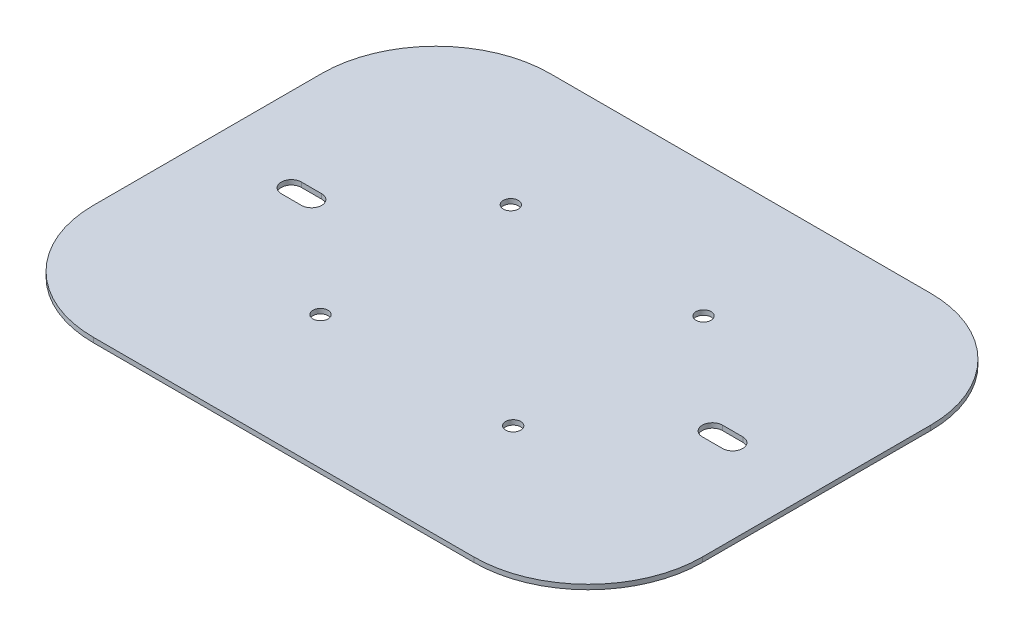
ISO-10303-21;
HEADER;
FILE_DESCRIPTION(('STEP AP214'),'2;1');
FILE_NAME('part.step','',(''),(''),'','','');
FILE_SCHEMA(('AUTOMOTIVE_DESIGN { 1 0 10303 214 1 1 1 1 }'));
ENDSEC;
DATA;
#1=APPLICATION_CONTEXT('core data for automotive mechanical design processes');
#2=APPLICATION_PROTOCOL_DEFINITION('international standard','automotive_design',2000,#1);
#3=PRODUCT_CONTEXT('',#1,'mechanical');
#4=PRODUCT('Part','Part','',(#3));
#5=PRODUCT_RELATED_PRODUCT_CATEGORY('part','',(#4));
#6=PRODUCT_DEFINITION_FORMATION('','',#4);
#7=PRODUCT_DEFINITION_CONTEXT('part definition',#1,'design');
#8=PRODUCT_DEFINITION('design','',#6,#7);
#9=PRODUCT_DEFINITION_SHAPE('','',#8);
#10=(LENGTH_UNIT() NAMED_UNIT(*) SI_UNIT(.MILLI.,.METRE.));
#11=(NAMED_UNIT(*) PLANE_ANGLE_UNIT() SI_UNIT($,.RADIAN.));
#12=(NAMED_UNIT(*) SI_UNIT($,.STERADIAN.) SOLID_ANGLE_UNIT());
#13=UNCERTAINTY_MEASURE_WITH_UNIT(LENGTH_MEASURE(1.E-05),#10,'distance_accuracy_value','');
#14=(GEOMETRIC_REPRESENTATION_CONTEXT(3) GLOBAL_UNCERTAINTY_ASSIGNED_CONTEXT((#13)) GLOBAL_UNIT_ASSIGNED_CONTEXT((#10,
#11,#12)) REPRESENTATION_CONTEXT('',''));
#15=CARTESIAN_POINT('',(0.,0.,0.));
#16=DIRECTION('',(0.,0.,1.));
#17=DIRECTION('',(1.,0.,0.));
#18=AXIS2_PLACEMENT_3D('',#15,#16,#17);
#19=CARTESIAN_POINT('',(330.2,3.175,-228.6));
#20=DIRECTION('',(0.,-1.,0.));
#21=DIRECTION('',(0.,0.,-1.));
#22=AXIS2_PLACEMENT_3D('',#19,#20,#21);
#23=CYLINDRICAL_SURFACE('',#22,76.2);
#24=CARTESIAN_POINT('',(330.2,0.,-228.6));
#25=DIRECTION('',(0.,1.,0.));
#26=DIRECTION('',(0.,0.,1.));
#27=AXIS2_PLACEMENT_3D('',#24,#25,#26);
#28=CIRCLE('',#27,76.2);
#29=CARTESIAN_POINT('',(406.4,0.,-228.599999999999));
#30=VERTEX_POINT('',#29);
#31=CARTESIAN_POINT('',(330.199999999999,0.,-304.8));
#32=VERTEX_POINT('',#31);
#33=EDGE_CURVE('E356',#30,#32,#28,.T.);
#34=ORIENTED_EDGE('',*,*,#33,.T.);
#35=DIRECTION('',(0.,-1.,0.));
#36=VECTOR('',#35,1.);
#37=CARTESIAN_POINT('',(330.199999999999,3.175,-304.8));
#38=LINE('',#37,#36);
#39=CARTESIAN_POINT('',(330.199999999999,3.175,-304.8));
#40=VERTEX_POINT('',#39);
#41=EDGE_CURVE('E13',#40,#32,#38,.T.);
#42=ORIENTED_EDGE('',*,*,#41,.F.);
#43=CARTESIAN_POINT('',(330.2,3.175,-228.6));
#44=DIRECTION('',(0.,1.,0.));
#45=DIRECTION('',(0.,0.,1.));
#46=AXIS2_PLACEMENT_3D('',#43,#44,#45);
#47=CIRCLE('',#46,76.2);
#48=CARTESIAN_POINT('',(406.4,3.175,-228.599999999999));
#49=VERTEX_POINT('',#48);
#50=EDGE_CURVE('E357',#49,#40,#47,.T.);
#51=ORIENTED_EDGE('',*,*,#50,.F.);
#52=DIRECTION('',(0.,-1.,0.));
#53=VECTOR('',#52,1.);
#54=CARTESIAN_POINT('',(406.4,3.175,-228.599999999999));
#55=LINE('',#54,#53);
#56=EDGE_CURVE('E375',#49,#30,#55,.T.);
#57=ORIENTED_EDGE('',*,*,#56,.T.);
#58=EDGE_LOOP('',(#34,#42,#51,#57));
#59=FACE_BOUND('',#58,.T.);
#60=ADVANCED_FACE('F180',(#59),#23,.T.);
#61=CARTESIAN_POINT('',(76.2000000000005,3.175,-304.8));
#62=DIRECTION('',(0.,0.,1.));
#63=DIRECTION('',(1.,0.,0.));
#64=AXIS2_PLACEMENT_3D('',#61,#62,#63);
#65=PLANE('',#64);
#66=DIRECTION('',(-1.,0.,0.));
#67=VECTOR('',#66,1.);
#68=CARTESIAN_POINT('',(76.2000000000005,0.,-304.8));
#69=LINE('',#68,#67);
#70=CARTESIAN_POINT('',(76.2,0.,-304.8));
#71=VERTEX_POINT('',#70);
#72=EDGE_CURVE('E378',#32,#71,#69,.T.);
#73=ORIENTED_EDGE('',*,*,#72,.T.);
#74=DIRECTION('',(0.,-1.,0.));
#75=VECTOR('',#74,1.);
#76=CARTESIAN_POINT('',(76.2,3.175,-304.8));
#77=LINE('',#76,#75);
#78=CARTESIAN_POINT('',(76.2,3.175,-304.8));
#79=VERTEX_POINT('',#78);
#80=EDGE_CURVE('E187',#79,#71,#77,.T.);
#81=ORIENTED_EDGE('',*,*,#80,.F.);
#82=DIRECTION('',(-1.,0.,0.));
#83=VECTOR('',#82,1.);
#84=CARTESIAN_POINT('',(76.2000000000005,3.175,-304.8));
#85=LINE('',#84,#83);
#86=EDGE_CURVE('E360',#40,#79,#85,.T.);
#87=ORIENTED_EDGE('',*,*,#86,.F.);
#88=ORIENTED_EDGE('',*,*,#41,.T.);
#89=EDGE_LOOP('',(#73,#81,#87,#88));
#90=FACE_BOUND('',#89,.T.);
#91=ADVANCED_FACE('F434',(#90),#65,.F.);
#92=CARTESIAN_POINT('',(76.2,3.175,-228.6));
#93=DIRECTION('',(0.,-1.,0.));
#94=DIRECTION('',(0.,0.,-1.));
#95=AXIS2_PLACEMENT_3D('',#92,#93,#94);
#96=CYLINDRICAL_SURFACE('',#95,76.2);
#97=CARTESIAN_POINT('',(76.2,0.,-228.6));
#98=DIRECTION('',(0.,1.,0.));
#99=DIRECTION('',(0.,0.,-1.));
#100=AXIS2_PLACEMENT_3D('',#97,#98,#99);
#101=CIRCLE('',#100,76.2);
#102=CARTESIAN_POINT('',(0.,0.,-228.599999999999));
#103=VERTEX_POINT('',#102);
#104=EDGE_CURVE('E380',#71,#103,#101,.T.);
#105=ORIENTED_EDGE('',*,*,#104,.T.);
#106=DIRECTION('',(0.,-1.,0.));
#107=VECTOR('',#106,1.);
#108=CARTESIAN_POINT('',(0.,3.175,-228.599999999999));
#109=LINE('',#108,#107);
#110=CARTESIAN_POINT('',(0.,3.175,-228.599999999999));
#111=VERTEX_POINT('',#110);
#112=EDGE_CURVE('E405',#111,#103,#109,.T.);
#113=ORIENTED_EDGE('',*,*,#112,.F.);
#114=CARTESIAN_POINT('',(76.2,3.175,-228.6));
#115=DIRECTION('',(0.,1.,0.));
#116=DIRECTION('',(0.,0.,-1.));
#117=AXIS2_PLACEMENT_3D('',#114,#115,#116);
#118=CIRCLE('',#117,76.2);
#119=EDGE_CURVE('E363',#79,#111,#118,.T.);
#120=ORIENTED_EDGE('',*,*,#119,.F.);
#121=ORIENTED_EDGE('',*,*,#80,.T.);
#122=EDGE_LOOP('',(#105,#113,#120,#121));
#123=FACE_BOUND('',#122,.T.);
#124=ADVANCED_FACE('F412',(#123),#96,.T.);
#125=CARTESIAN_POINT('',(0.,3.175,-76.2000000000005));
#126=DIRECTION('',(1.,0.,0.));
#127=DIRECTION('',(0.,0.,-1.));
#128=AXIS2_PLACEMENT_3D('',#125,#126,#127);
#129=PLANE('',#128);
#130=DIRECTION('',(0.,0.,1.));
#131=VECTOR('',#130,1.);
#132=CARTESIAN_POINT('',(0.,0.,-76.2000000000005));
#133=LINE('',#132,#131);
#134=CARTESIAN_POINT('',(0.,0.,-76.2000000000005));
#135=VERTEX_POINT('',#134);
#136=EDGE_CURVE('E382',#103,#135,#133,.T.);
#137=ORIENTED_EDGE('',*,*,#136,.T.);
#138=DIRECTION('',(0.,-1.,0.));
#139=VECTOR('',#138,1.);
#140=CARTESIAN_POINT('',(0.,3.175,-76.2000000000005));
#141=LINE('',#140,#139);
#142=CARTESIAN_POINT('',(0.,3.175,-76.2000000000005));
#143=VERTEX_POINT('',#142);
#144=EDGE_CURVE('E402',#143,#135,#141,.T.);
#145=ORIENTED_EDGE('',*,*,#144,.F.);
#146=DIRECTION('',(0.,0.,1.));
#147=VECTOR('',#146,1.);
#148=CARTESIAN_POINT('',(0.,3.175,-76.2000000000005));
#149=LINE('',#148,#147);
#150=EDGE_CURVE('E365',#111,#143,#149,.T.);
#151=ORIENTED_EDGE('',*,*,#150,.F.);
#152=ORIENTED_EDGE('',*,*,#112,.T.);
#153=EDGE_LOOP('',(#137,#145,#151,#152));
#154=FACE_BOUND('',#153,.T.);
#155=ADVANCED_FACE('F422',(#154),#129,.F.);
#156=CARTESIAN_POINT('',(76.2,3.175,-76.2));
#157=DIRECTION('',(0.,-1.,0.));
#158=DIRECTION('',(0.,0.,-1.));
#159=AXIS2_PLACEMENT_3D('',#156,#157,#158);
#160=CYLINDRICAL_SURFACE('',#159,76.2);
#161=CARTESIAN_POINT('',(76.2,0.,-76.2));
#162=DIRECTION('',(0.,1.,0.));
#163=DIRECTION('',(0.,0.,-1.));
#164=AXIS2_PLACEMENT_3D('',#161,#162,#163);
#165=CIRCLE('',#164,76.2);
#166=CARTESIAN_POINT('',(76.2000000000005,0.,0.));
#167=VERTEX_POINT('',#166);
#168=EDGE_CURVE('E384',#135,#167,#165,.T.);
#169=ORIENTED_EDGE('',*,*,#168,.T.);
#170=DIRECTION('',(0.,-1.,0.));
#171=VECTOR('',#170,1.);
#172=CARTESIAN_POINT('',(76.2000000000005,3.175,0.));
#173=LINE('',#172,#171);
#174=CARTESIAN_POINT('',(76.2000000000005,3.175,0.));
#175=VERTEX_POINT('',#174);
#176=EDGE_CURVE('E399',#175,#167,#173,.T.);
#177=ORIENTED_EDGE('',*,*,#176,.F.);
#178=CARTESIAN_POINT('',(76.2,3.175,-76.2));
#179=DIRECTION('',(0.,1.,0.));
#180=DIRECTION('',(0.,0.,-1.));
#181=AXIS2_PLACEMENT_3D('',#178,#179,#180);
#182=CIRCLE('',#181,76.2);
#183=EDGE_CURVE('E367',#143,#175,#182,.T.);
#184=ORIENTED_EDGE('',*,*,#183,.F.);
#185=ORIENTED_EDGE('',*,*,#144,.T.);
#186=EDGE_LOOP('',(#169,#177,#184,#185));
#187=FACE_BOUND('',#186,.T.);
#188=ADVANCED_FACE('F426',(#187),#160,.T.);
#189=CARTESIAN_POINT('',(76.2000000000005,3.175,0.));
#190=DIRECTION('',(0.,0.,-1.));
#191=DIRECTION('',(-1.,0.,0.));
#192=AXIS2_PLACEMENT_3D('',#189,#190,#191);
#193=PLANE('',#192);
#194=DIRECTION('',(1.,0.,0.));
#195=VECTOR('',#194,1.);
#196=CARTESIAN_POINT('',(76.2000000000005,0.,0.));
#197=LINE('',#196,#195);
#198=CARTESIAN_POINT('',(330.199999999999,0.,0.));
#199=VERTEX_POINT('',#198);
#200=EDGE_CURVE('E386',#167,#199,#197,.T.);
#201=ORIENTED_EDGE('',*,*,#200,.T.);
#202=DIRECTION('',(0.,-1.,0.));
#203=VECTOR('',#202,1.);
#204=CARTESIAN_POINT('',(330.199999999999,3.175,0.));
#205=LINE('',#204,#203);
#206=CARTESIAN_POINT('',(330.199999999999,3.175,0.));
#207=VERTEX_POINT('',#206);
#208=EDGE_CURVE('E396',#207,#199,#205,.T.);
#209=ORIENTED_EDGE('',*,*,#208,.F.);
#210=DIRECTION('',(1.,0.,0.));
#211=VECTOR('',#210,1.);
#212=CARTESIAN_POINT('',(76.2000000000005,3.175,0.));
#213=LINE('',#212,#211);
#214=EDGE_CURVE('E369',#175,#207,#213,.T.);
#215=ORIENTED_EDGE('',*,*,#214,.F.);
#216=ORIENTED_EDGE('',*,*,#176,.T.);
#217=EDGE_LOOP('',(#201,#209,#215,#216));
#218=FACE_BOUND('',#217,.T.);
#219=ADVANCED_FACE('F447',(#218),#193,.F.);
#220=CARTESIAN_POINT('',(330.2,3.175,-76.2));
#221=DIRECTION('',(0.,-1.,0.));
#222=DIRECTION('',(0.,0.,-1.));
#223=AXIS2_PLACEMENT_3D('',#220,#221,#222);
#224=CYLINDRICAL_SURFACE('',#223,76.2);
#225=CARTESIAN_POINT('',(330.2,0.,-76.2));
#226=DIRECTION('',(0.,1.,0.));
#227=DIRECTION('',(0.,0.,-1.));
#228=AXIS2_PLACEMENT_3D('',#225,#226,#227);
#229=CIRCLE('',#228,76.2);
#230=CARTESIAN_POINT('',(406.4,0.,-76.2000000000005));
#231=VERTEX_POINT('',#230);
#232=EDGE_CURVE('E388',#199,#231,#229,.T.);
#233=ORIENTED_EDGE('',*,*,#232,.T.);
#234=DIRECTION('',(0.,-1.,0.));
#235=VECTOR('',#234,1.);
#236=CARTESIAN_POINT('',(406.4,3.175,-76.2000000000005));
#237=LINE('',#236,#235);
#238=CARTESIAN_POINT('',(406.4,3.175,-76.2000000000005));
#239=VERTEX_POINT('',#238);
#240=EDGE_CURVE('E393',#239,#231,#237,.T.);
#241=ORIENTED_EDGE('',*,*,#240,.F.);
#242=CARTESIAN_POINT('',(330.2,3.175,-76.2));
#243=DIRECTION('',(0.,1.,0.));
#244=DIRECTION('',(0.,0.,-1.));
#245=AXIS2_PLACEMENT_3D('',#242,#243,#244);
#246=CIRCLE('',#245,76.2);
#247=EDGE_CURVE('E371',#207,#239,#246,.T.);
#248=ORIENTED_EDGE('',*,*,#247,.F.);
#249=ORIENTED_EDGE('',*,*,#208,.T.);
#250=EDGE_LOOP('',(#233,#241,#248,#249));
#251=FACE_BOUND('',#250,.T.);
#252=ADVANCED_FACE('F445',(#251),#224,.T.);
#253=CARTESIAN_POINT('',(406.4,3.175,-76.2000000000005));
#254=DIRECTION('',(-1.,0.,0.));
#255=DIRECTION('',(0.,0.,1.));
#256=AXIS2_PLACEMENT_3D('',#253,#254,#255);
#257=PLANE('',#256);
#258=DIRECTION('',(0.,0.,-1.));
#259=VECTOR('',#258,1.);
#260=CARTESIAN_POINT('',(406.4,0.,-76.2000000000005));
#261=LINE('',#260,#259);
#262=EDGE_CURVE('E361',#231,#30,#261,.T.);
#263=ORIENTED_EDGE('',*,*,#262,.T.);
#264=ORIENTED_EDGE('',*,*,#56,.F.);
#265=DIRECTION('',(0.,0.,-1.));
#266=VECTOR('',#265,1.);
#267=CARTESIAN_POINT('',(406.4,3.175,-76.2000000000005));
#268=LINE('',#267,#266);
#269=EDGE_CURVE('E373',#239,#49,#268,.T.);
#270=ORIENTED_EDGE('',*,*,#269,.F.);
#271=ORIENTED_EDGE('',*,*,#240,.T.);
#272=EDGE_LOOP('',(#263,#264,#270,#271));
#273=FACE_BOUND('',#272,.T.);
#274=ADVANCED_FACE('F440',(#273),#257,.F.);
#275=CARTESIAN_POINT('',(330.2,3.175,-228.6));
#276=DIRECTION('',(0.,1.,0.));
#277=DIRECTION('',(0.,0.,1.));
#278=AXIS2_PLACEMENT_3D('',#275,#276,#277);
#279=PLANE('',#278);
#280=CARTESIAN_POINT('',(267.49375,3.175,-215.9));
#281=DIRECTION('',(0.,1.,0.));
#282=DIRECTION('',(0.,0.,1.));
#283=AXIS2_PLACEMENT_3D('',#280,#281,#282);
#284=CIRCLE('',#283,5.04189999999999);
#285=CARTESIAN_POINT('',(267.49375,3.175,-210.8581));
#286=VERTEX_POINT('',#285);
#287=EDGE_CURVE('E636',#286,#286,#284,.T.);
#288=ORIENTED_EDGE('',*,*,#287,.F.);
#289=EDGE_LOOP('',(#288));
#290=FACE_BOUND('',#289,.T.);
#291=CARTESIAN_POINT('',(267.49375,3.175,-88.9));
#292=DIRECTION('',(0.,1.,0.));
#293=DIRECTION('',(0.,0.,1.));
#294=AXIS2_PLACEMENT_3D('',#291,#292,#293);
#295=CIRCLE('',#294,5.04189999999999);
#296=CARTESIAN_POINT('',(267.49375,3.175,-83.8581));
#297=VERTEX_POINT('',#296);
#298=EDGE_CURVE('E638',#297,#297,#295,.T.);
#299=ORIENTED_EDGE('',*,*,#298,.F.);
#300=EDGE_LOOP('',(#299));
#301=FACE_BOUND('',#300,.T.);
#302=CARTESIAN_POINT('',(138.906249999999,3.175,-215.9));
#303=DIRECTION('',(0.,1.,0.));
#304=DIRECTION('',(0.,0.,1.));
#305=AXIS2_PLACEMENT_3D('',#302,#303,#304);
#306=CIRCLE('',#305,5.04189999999999);
#307=CARTESIAN_POINT('',(138.906249999999,3.175,-210.8581));
#308=VERTEX_POINT('',#307);
#309=EDGE_CURVE('E646',#308,#308,#306,.T.);
#310=ORIENTED_EDGE('',*,*,#309,.F.);
#311=EDGE_LOOP('',(#310));
#312=FACE_BOUND('',#311,.T.);
#313=CARTESIAN_POINT('',(138.90625,3.175,-88.9));
#314=DIRECTION('',(0.,1.,0.));
#315=DIRECTION('',(0.,0.,1.));
#316=AXIS2_PLACEMENT_3D('',#313,#314,#315);
#317=CIRCLE('',#316,5.04189999999999);
#318=CARTESIAN_POINT('',(138.90625,3.175,-83.8581));
#319=VERTEX_POINT('',#318);
#320=EDGE_CURVE('E652',#319,#319,#317,.T.);
#321=ORIENTED_EDGE('',*,*,#320,.F.);
#322=EDGE_LOOP('',(#321));
#323=FACE_BOUND('',#322,.T.);
#324=CARTESIAN_POINT('',(69.4537599999997,3.175,-152.4));
#325=DIRECTION('',(0.,1.,0.));
#326=DIRECTION('',(0.,0.,1.));
#327=AXIS2_PLACEMENT_3D('',#324,#325,#326);
#328=CIRCLE('',#327,6.74623999999999);
#329=CARTESIAN_POINT('',(69.4537599999997,3.175,-145.65376));
#330=VERTEX_POINT('',#329);
#331=CARTESIAN_POINT('',(69.4537599999997,3.175,-159.14624));
#332=VERTEX_POINT('',#331);
#333=EDGE_CURVE('E316',#330,#332,#328,.T.);
#334=ORIENTED_EDGE('',*,*,#333,.F.);
#335=DIRECTION('',(1.,0.,0.));
#336=VECTOR('',#335,1.);
#337=CARTESIAN_POINT('',(55.9587399999997,3.175,-145.65376));
#338=LINE('',#337,#336);
#339=CARTESIAN_POINT('',(55.9587399999997,3.175,-145.65376));
#340=VERTEX_POINT('',#339);
#341=EDGE_CURVE('E300',#340,#330,#338,.T.);
#342=ORIENTED_EDGE('',*,*,#341,.F.);
#343=CARTESIAN_POINT('',(55.9587399999997,3.175,-152.4));
#344=DIRECTION('',(0.,1.,0.));
#345=DIRECTION('',(0.,0.,1.));
#346=AXIS2_PLACEMENT_3D('',#343,#344,#345);
#347=CIRCLE('',#346,6.74623999999999);
#348=CARTESIAN_POINT('',(55.9587399999997,3.175,-159.14624));
#349=VERTEX_POINT('',#348);
#350=EDGE_CURVE('E304',#349,#340,#347,.T.);
#351=ORIENTED_EDGE('',*,*,#350,.F.);
#352=DIRECTION('',(1.,0.,0.));
#353=VECTOR('',#352,1.);
#354=CARTESIAN_POINT('',(55.9587399999997,3.175,-159.14624));
#355=LINE('',#354,#353);
#356=EDGE_CURVE('E311',#349,#332,#355,.T.);
#357=ORIENTED_EDGE('',*,*,#356,.T.);
#358=EDGE_LOOP('',(#334,#342,#351,#357));
#359=FACE_BOUND('',#358,.T.);
#360=DIRECTION('',(1.,0.,0.));
#361=VECTOR('',#360,1.);
#362=CARTESIAN_POINT('',(336.94624,3.175,-145.65376));
#363=LINE('',#362,#361);
#364=CARTESIAN_POINT('',(336.94624,3.175,-145.65376));
#365=VERTEX_POINT('',#364);
#366=CARTESIAN_POINT('',(350.44126,3.175,-145.65376));
#367=VERTEX_POINT('',#366);
#368=EDGE_CURVE('E324',#365,#367,#363,.T.);
#369=ORIENTED_EDGE('',*,*,#368,.F.);
#370=CARTESIAN_POINT('',(336.94624,3.175,-152.4));
#371=DIRECTION('',(0.,1.,0.));
#372=DIRECTION('',(0.,0.,1.));
#373=AXIS2_PLACEMENT_3D('',#370,#371,#372);
#374=CIRCLE('',#373,6.74624000000001);
#375=CARTESIAN_POINT('',(336.94624,3.175,-159.14624));
#376=VERTEX_POINT('',#375);
#377=EDGE_CURVE('E334',#376,#365,#374,.T.);
#378=ORIENTED_EDGE('',*,*,#377,.F.);
#379=DIRECTION('',(1.,0.,0.));
#380=VECTOR('',#379,1.);
#381=CARTESIAN_POINT('',(336.94624,3.175,-159.14624));
#382=LINE('',#381,#380);
#383=CARTESIAN_POINT('',(350.44126,3.175,-159.14624));
#384=VERTEX_POINT('',#383);
#385=EDGE_CURVE('E331',#376,#384,#382,.T.);
#386=ORIENTED_EDGE('',*,*,#385,.T.);
#387=CARTESIAN_POINT('',(350.44126,3.175,-152.4));
#388=DIRECTION('',(0.,1.,0.));
#389=DIRECTION('',(0.,0.,1.));
#390=AXIS2_PLACEMENT_3D('',#387,#388,#389);
#391=CIRCLE('',#390,6.74624000000001);
#392=EDGE_CURVE('E345',#367,#384,#391,.T.);
#393=ORIENTED_EDGE('',*,*,#392,.F.);
#394=EDGE_LOOP('',(#369,#378,#386,#393));
#395=FACE_BOUND('',#394,.T.);
#396=ORIENTED_EDGE('',*,*,#50,.T.);
#397=ORIENTED_EDGE('',*,*,#86,.T.);
#398=ORIENTED_EDGE('',*,*,#119,.T.);
#399=ORIENTED_EDGE('',*,*,#150,.T.);
#400=ORIENTED_EDGE('',*,*,#183,.T.);
#401=ORIENTED_EDGE('',*,*,#214,.T.);
#402=ORIENTED_EDGE('',*,*,#247,.T.);
#403=ORIENTED_EDGE('',*,*,#269,.T.);
#404=EDGE_LOOP('',(#396,#397,#398,#399,#400,#401,#402,#403));
#405=FACE_BOUND('',#404,.T.);
#406=ADVANCED_FACE('F430',(#290,#301,#312,#323,#359,#395,#405),#279,.T.);
#407=CARTESIAN_POINT('',(330.2,0.,-228.6));
#408=DIRECTION('',(0.,1.,0.));
#409=DIRECTION('',(0.,0.,1.));
#410=AXIS2_PLACEMENT_3D('',#407,#408,#409);
#411=PLANE('',#410);
#412=CARTESIAN_POINT('',(267.49375,0.,-215.9));
#413=DIRECTION('',(0.,1.,0.));
#414=DIRECTION('',(0.,0.,1.));
#415=AXIS2_PLACEMENT_3D('',#412,#413,#414);
#416=CIRCLE('',#415,5.04189999999999);
#417=CARTESIAN_POINT('',(267.49375,0.,-210.8581));
#418=VERTEX_POINT('',#417);
#419=EDGE_CURVE('E633',#418,#418,#416,.T.);
#420=ORIENTED_EDGE('',*,*,#419,.T.);
#421=EDGE_LOOP('',(#420));
#422=FACE_BOUND('',#421,.T.);
#423=CARTESIAN_POINT('',(267.49375,0.,-88.9));
#424=DIRECTION('',(0.,1.,0.));
#425=DIRECTION('',(0.,0.,1.));
#426=AXIS2_PLACEMENT_3D('',#423,#424,#425);
#427=CIRCLE('',#426,5.04189999999999);
#428=CARTESIAN_POINT('',(267.49375,0.,-83.8581));
#429=VERTEX_POINT('',#428);
#430=EDGE_CURVE('E643',#429,#429,#427,.T.);
#431=ORIENTED_EDGE('',*,*,#430,.T.);
#432=EDGE_LOOP('',(#431));
#433=FACE_BOUND('',#432,.T.);
#434=CARTESIAN_POINT('',(138.906249999999,0.,-215.9));
#435=DIRECTION('',(0.,1.,0.));
#436=DIRECTION('',(0.,0.,1.));
#437=AXIS2_PLACEMENT_3D('',#434,#435,#436);
#438=CIRCLE('',#437,5.04189999999999);
#439=CARTESIAN_POINT('',(138.906249999999,0.,-210.8581));
#440=VERTEX_POINT('',#439);
#441=EDGE_CURVE('E649',#440,#440,#438,.T.);
#442=ORIENTED_EDGE('',*,*,#441,.T.);
#443=EDGE_LOOP('',(#442));
#444=FACE_BOUND('',#443,.T.);
#445=CARTESIAN_POINT('',(138.90625,0.,-88.9));
#446=DIRECTION('',(0.,1.,0.));
#447=DIRECTION('',(0.,0.,1.));
#448=AXIS2_PLACEMENT_3D('',#445,#446,#447);
#449=CIRCLE('',#448,5.04189999999999);
#450=CARTESIAN_POINT('',(138.90625,0.,-83.8581));
#451=VERTEX_POINT('',#450);
#452=EDGE_CURVE('E655',#451,#451,#449,.T.);
#453=ORIENTED_EDGE('',*,*,#452,.T.);
#454=EDGE_LOOP('',(#453));
#455=FACE_BOUND('',#454,.T.);
#456=CARTESIAN_POINT('',(55.9587399999997,0.,-152.4));
#457=DIRECTION('',(0.,1.,0.));
#458=DIRECTION('',(0.,0.,1.));
#459=AXIS2_PLACEMENT_3D('',#456,#457,#458);
#460=CIRCLE('',#459,6.74624);
#461=CARTESIAN_POINT('',(55.9587399999997,0.,-159.14624));
#462=VERTEX_POINT('',#461);
#463=CARTESIAN_POINT('',(55.9587399999997,0.,-145.65376));
#464=VERTEX_POINT('',#463);
#465=EDGE_CURVE('E199',#462,#464,#460,.T.);
#466=ORIENTED_EDGE('',*,*,#465,.T.);
#467=DIRECTION('',(1.,0.,0.));
#468=VECTOR('',#467,1.);
#469=CARTESIAN_POINT('',(55.9587399999997,0.,-145.65376));
#470=LINE('',#469,#468);
#471=CARTESIAN_POINT('',(69.4537599999997,0.,-145.65376));
#472=VERTEX_POINT('',#471);
#473=EDGE_CURVE('E292',#464,#472,#470,.T.);
#474=ORIENTED_EDGE('',*,*,#473,.T.);
#475=CARTESIAN_POINT('',(69.4537599999997,0.,-152.4));
#476=DIRECTION('',(0.,1.,0.));
#477=DIRECTION('',(0.,0.,1.));
#478=AXIS2_PLACEMENT_3D('',#475,#476,#477);
#479=CIRCLE('',#478,6.74624);
#480=CARTESIAN_POINT('',(69.4537599999997,0.,-159.14624));
#481=VERTEX_POINT('',#480);
#482=EDGE_CURVE('E319',#472,#481,#479,.T.);
#483=ORIENTED_EDGE('',*,*,#482,.T.);
#484=DIRECTION('',(1.,0.,0.));
#485=VECTOR('',#484,1.);
#486=CARTESIAN_POINT('',(55.9587399999997,0.,-159.14624));
#487=LINE('',#486,#485);
#488=EDGE_CURVE('E299',#462,#481,#487,.T.);
#489=ORIENTED_EDGE('',*,*,#488,.F.);
#490=EDGE_LOOP('',(#466,#474,#483,#489));
#491=FACE_BOUND('',#490,.T.);
#492=DIRECTION('',(1.,0.,0.));
#493=VECTOR('',#492,1.);
#494=CARTESIAN_POINT('',(336.94624,0.,-145.65376));
#495=LINE('',#494,#493);
#496=CARTESIAN_POINT('',(336.94624,0.,-145.65376));
#497=VERTEX_POINT('',#496);
#498=CARTESIAN_POINT('',(350.44126,0.,-145.65376));
#499=VERTEX_POINT('',#498);
#500=EDGE_CURVE('E326',#497,#499,#495,.T.);
#501=ORIENTED_EDGE('',*,*,#500,.T.);
#502=CARTESIAN_POINT('',(350.44126,0.,-152.4));
#503=DIRECTION('',(0.,1.,0.));
#504=DIRECTION('',(0.,0.,1.));
#505=AXIS2_PLACEMENT_3D('',#502,#503,#504);
#506=CIRCLE('',#505,6.74624000000001);
#507=CARTESIAN_POINT('',(350.44126,0.,-159.14624));
#508=VERTEX_POINT('',#507);
#509=EDGE_CURVE('E348',#499,#508,#506,.T.);
#510=ORIENTED_EDGE('',*,*,#509,.T.);
#511=DIRECTION('',(1.,0.,0.));
#512=VECTOR('',#511,1.);
#513=CARTESIAN_POINT('',(336.94624,0.,-159.14624));
#514=LINE('',#513,#512);
#515=CARTESIAN_POINT('',(336.94624,0.,-159.14624));
#516=VERTEX_POINT('',#515);
#517=EDGE_CURVE('E329',#516,#508,#514,.T.);
#518=ORIENTED_EDGE('',*,*,#517,.F.);
#519=CARTESIAN_POINT('',(336.94624,0.,-152.4));
#520=DIRECTION('',(0.,1.,0.));
#521=DIRECTION('',(0.,0.,1.));
#522=AXIS2_PLACEMENT_3D('',#519,#520,#521);
#523=CIRCLE('',#522,6.74624000000001);
#524=EDGE_CURVE('E337',#516,#497,#523,.T.);
#525=ORIENTED_EDGE('',*,*,#524,.T.);
#526=EDGE_LOOP('',(#501,#510,#518,#525));
#527=FACE_BOUND('',#526,.T.);
#528=ORIENTED_EDGE('',*,*,#33,.F.);
#529=ORIENTED_EDGE('',*,*,#262,.F.);
#530=ORIENTED_EDGE('',*,*,#232,.F.);
#531=ORIENTED_EDGE('',*,*,#200,.F.);
#532=ORIENTED_EDGE('',*,*,#168,.F.);
#533=ORIENTED_EDGE('',*,*,#136,.F.);
#534=ORIENTED_EDGE('',*,*,#104,.F.);
#535=ORIENTED_EDGE('',*,*,#72,.F.);
#536=EDGE_LOOP('',(#528,#529,#530,#531,#532,#533,#534,#535));
#537=FACE_BOUND('',#536,.T.);
#538=ADVANCED_FACE('F308',(#422,#433,#444,#455,#491,#527,#537),#411,.F.);
#539=CARTESIAN_POINT('',(350.44126,3.175,-152.4));
#540=DIRECTION('',(0.,1.,0.));
#541=DIRECTION('',(0.,0.,1.));
#542=AXIS2_PLACEMENT_3D('',#539,#540,#541);
#543=CYLINDRICAL_SURFACE('',#542,6.74624000000001);
#544=ORIENTED_EDGE('',*,*,#509,.F.);
#545=DIRECTION('',(0.,1.,0.));
#546=VECTOR('',#545,1.);
#547=CARTESIAN_POINT('',(350.44126,3.175,-145.65376));
#548=LINE('',#547,#546);
#549=EDGE_CURVE('E353',#367,#499,#548,.F.);
#550=ORIENTED_EDGE('',*,*,#549,.F.);
#551=ORIENTED_EDGE('',*,*,#392,.T.);
#552=DIRECTION('',(0.,1.,0.));
#553=VECTOR('',#552,1.);
#554=CARTESIAN_POINT('',(350.44126,3.175,-159.14624));
#555=LINE('',#554,#553);
#556=EDGE_CURVE('E351',#508,#384,#555,.T.);
#557=ORIENTED_EDGE('',*,*,#556,.F.);
#558=EDGE_LOOP('',(#544,#550,#551,#557));
#559=FACE_BOUND('',#558,.T.);
#560=ADVANCED_FACE('F499',(#559),#543,.F.);
#561=CARTESIAN_POINT('',(336.94624,3.175,-152.4));
#562=DIRECTION('',(0.,1.,0.));
#563=DIRECTION('',(0.,0.,1.));
#564=AXIS2_PLACEMENT_3D('',#561,#562,#563);
#565=CYLINDRICAL_SURFACE('',#564,6.74624000000001);
#566=ORIENTED_EDGE('',*,*,#377,.T.);
#567=DIRECTION('',(0.,1.,0.));
#568=VECTOR('',#567,1.);
#569=CARTESIAN_POINT('',(336.94624,3.175,-145.65376));
#570=LINE('',#569,#568);
#571=EDGE_CURVE('E340',#497,#365,#570,.T.);
#572=ORIENTED_EDGE('',*,*,#571,.F.);
#573=ORIENTED_EDGE('',*,*,#524,.F.);
#574=DIRECTION('',(0.,1.,0.));
#575=VECTOR('',#574,1.);
#576=CARTESIAN_POINT('',(336.94624,3.175,-159.14624));
#577=LINE('',#576,#575);
#578=EDGE_CURVE('E342',#376,#516,#577,.F.);
#579=ORIENTED_EDGE('',*,*,#578,.F.);
#580=EDGE_LOOP('',(#566,#572,#573,#579));
#581=FACE_BOUND('',#580,.T.);
#582=ADVANCED_FACE('F504',(#581),#565,.F.);
#583=CARTESIAN_POINT('',(336.94624,3.175,-159.14624));
#584=DIRECTION('',(0.,0.,-1.));
#585=DIRECTION('',(-1.,0.,0.));
#586=AXIS2_PLACEMENT_3D('',#583,#584,#585);
#587=PLANE('',#586);
#588=ORIENTED_EDGE('',*,*,#556,.T.);
#589=ORIENTED_EDGE('',*,*,#385,.F.);
#590=ORIENTED_EDGE('',*,*,#578,.T.);
#591=ORIENTED_EDGE('',*,*,#517,.T.);
#592=EDGE_LOOP('',(#588,#589,#590,#591));
#593=FACE_BOUND('',#592,.T.);
#594=ADVANCED_FACE('F516',(#593),#587,.F.);
#595=CARTESIAN_POINT('',(336.94624,3.175,-145.65376));
#596=DIRECTION('',(0.,0.,1.));
#597=DIRECTION('',(1.,0.,0.));
#598=AXIS2_PLACEMENT_3D('',#595,#596,#597);
#599=PLANE('',#598);
#600=ORIENTED_EDGE('',*,*,#549,.T.);
#601=ORIENTED_EDGE('',*,*,#500,.F.);
#602=ORIENTED_EDGE('',*,*,#571,.T.);
#603=ORIENTED_EDGE('',*,*,#368,.T.);
#604=EDGE_LOOP('',(#600,#601,#602,#603));
#605=FACE_BOUND('',#604,.T.);
#606=ADVANCED_FACE('F526',(#605),#599,.F.);
#607=CARTESIAN_POINT('',(69.4537599999997,3.175,-152.4));
#608=DIRECTION('',(0.,1.,0.));
#609=DIRECTION('',(0.,0.,1.));
#610=AXIS2_PLACEMENT_3D('',#607,#608,#609);
#611=CYLINDRICAL_SURFACE('',#610,6.74623999999999);
#612=ORIENTED_EDGE('',*,*,#482,.F.);
#613=DIRECTION('',(0.,1.,0.));
#614=VECTOR('',#613,1.);
#615=CARTESIAN_POINT('',(69.4537599999997,3.175,-145.65376));
#616=LINE('',#615,#614);
#617=EDGE_CURVE('E296',#330,#472,#616,.F.);
#618=ORIENTED_EDGE('',*,*,#617,.F.);
#619=ORIENTED_EDGE('',*,*,#333,.T.);
#620=DIRECTION('',(0.,1.,0.));
#621=VECTOR('',#620,1.);
#622=CARTESIAN_POINT('',(69.4537599999997,3.175,-159.14624));
#623=LINE('',#622,#621);
#624=EDGE_CURVE('E321',#481,#332,#623,.T.);
#625=ORIENTED_EDGE('',*,*,#624,.F.);
#626=EDGE_LOOP('',(#612,#618,#619,#625));
#627=FACE_BOUND('',#626,.T.);
#628=ADVANCED_FACE('F536',(#627),#611,.F.);
#629=CARTESIAN_POINT('',(55.9587399999997,3.175,-152.4));
#630=DIRECTION('',(0.,1.,0.));
#631=DIRECTION('',(0.,0.,1.));
#632=AXIS2_PLACEMENT_3D('',#629,#630,#631);
#633=CYLINDRICAL_SURFACE('',#632,6.74623999999999);
#634=ORIENTED_EDGE('',*,*,#350,.T.);
#635=DIRECTION('',(0.,1.,0.));
#636=VECTOR('',#635,1.);
#637=CARTESIAN_POINT('',(55.9587399999997,3.175,-145.65376));
#638=LINE('',#637,#636);
#639=EDGE_CURVE('E294',#464,#340,#638,.T.);
#640=ORIENTED_EDGE('',*,*,#639,.F.);
#641=ORIENTED_EDGE('',*,*,#465,.F.);
#642=DIRECTION('',(0.,1.,0.));
#643=VECTOR('',#642,1.);
#644=CARTESIAN_POINT('',(55.9587399999997,3.175,-159.14624));
#645=LINE('',#644,#643);
#646=EDGE_CURVE('E194',#349,#462,#645,.F.);
#647=ORIENTED_EDGE('',*,*,#646,.F.);
#648=EDGE_LOOP('',(#634,#640,#641,#647));
#649=FACE_BOUND('',#648,.T.);
#650=ADVANCED_FACE('F302',(#649),#633,.F.);
#651=CARTESIAN_POINT('',(55.9587399999997,3.175,-159.14624));
#652=DIRECTION('',(0.,0.,-1.));
#653=DIRECTION('',(-1.,0.,0.));
#654=AXIS2_PLACEMENT_3D('',#651,#652,#653);
#655=PLANE('',#654);
#656=ORIENTED_EDGE('',*,*,#624,.T.);
#657=ORIENTED_EDGE('',*,*,#356,.F.);
#658=ORIENTED_EDGE('',*,*,#646,.T.);
#659=ORIENTED_EDGE('',*,*,#488,.T.);
#660=EDGE_LOOP('',(#656,#657,#658,#659));
#661=FACE_BOUND('',#660,.T.);
#662=ADVANCED_FACE('F555',(#661),#655,.F.);
#663=CARTESIAN_POINT('',(55.9587399999997,3.175,-145.65376));
#664=DIRECTION('',(0.,0.,1.));
#665=DIRECTION('',(1.,0.,0.));
#666=AXIS2_PLACEMENT_3D('',#663,#664,#665);
#667=PLANE('',#666);
#668=ORIENTED_EDGE('',*,*,#617,.T.);
#669=ORIENTED_EDGE('',*,*,#473,.F.);
#670=ORIENTED_EDGE('',*,*,#639,.T.);
#671=ORIENTED_EDGE('',*,*,#341,.T.);
#672=EDGE_LOOP('',(#668,#669,#670,#671));
#673=FACE_BOUND('',#672,.T.);
#674=ADVANCED_FACE('F293',(#673),#667,.F.);
#675=CARTESIAN_POINT('',(138.90625,3.175,-88.9));
#676=DIRECTION('',(0.,1.,0.));
#677=DIRECTION('',(0.,0.,1.));
#678=AXIS2_PLACEMENT_3D('',#675,#676,#677);
#679=CYLINDRICAL_SURFACE('',#678,5.04189999999999);
#680=ORIENTED_EDGE('',*,*,#452,.F.);
#681=EDGE_LOOP('',(#680));
#682=FACE_BOUND('',#681,.T.);
#683=ORIENTED_EDGE('',*,*,#320,.T.);
#684=EDGE_LOOP('',(#683));
#685=FACE_BOUND('',#684,.T.);
#686=ADVANCED_FACE('F573',(#682,#685),#679,.F.);
#687=CARTESIAN_POINT('',(138.906249999999,3.175,-215.9));
#688=DIRECTION('',(0.,1.,0.));
#689=DIRECTION('',(0.,0.,1.));
#690=AXIS2_PLACEMENT_3D('',#687,#688,#689);
#691=CYLINDRICAL_SURFACE('',#690,5.04189999999999);
#692=ORIENTED_EDGE('',*,*,#441,.F.);
#693=EDGE_LOOP('',(#692));
#694=FACE_BOUND('',#693,.T.);
#695=ORIENTED_EDGE('',*,*,#309,.T.);
#696=EDGE_LOOP('',(#695));
#697=FACE_BOUND('',#696,.T.);
#698=ADVANCED_FACE('F596',(#694,#697),#691,.F.);
#699=CARTESIAN_POINT('',(267.49375,3.175,-88.9));
#700=DIRECTION('',(0.,1.,0.));
#701=DIRECTION('',(0.,0.,1.));
#702=AXIS2_PLACEMENT_3D('',#699,#700,#701);
#703=CYLINDRICAL_SURFACE('',#702,5.04189999999999);
#704=ORIENTED_EDGE('',*,*,#430,.F.);
#705=EDGE_LOOP('',(#704));
#706=FACE_BOUND('',#705,.T.);
#707=ORIENTED_EDGE('',*,*,#298,.T.);
#708=EDGE_LOOP('',(#707));
#709=FACE_BOUND('',#708,.T.);
#710=ADVANCED_FACE('F606',(#706,#709),#703,.F.);
#711=CARTESIAN_POINT('',(267.49375,3.175,-215.9));
#712=DIRECTION('',(0.,1.,0.));
#713=DIRECTION('',(0.,0.,1.));
#714=AXIS2_PLACEMENT_3D('',#711,#712,#713);
#715=CYLINDRICAL_SURFACE('',#714,5.04189999999999);
#716=ORIENTED_EDGE('',*,*,#419,.F.);
#717=EDGE_LOOP('',(#716));
#718=FACE_BOUND('',#717,.T.);
#719=ORIENTED_EDGE('',*,*,#287,.T.);
#720=EDGE_LOOP('',(#719));
#721=FACE_BOUND('',#720,.T.);
#722=ADVANCED_FACE('F616',(#718,#721),#715,.F.);
#723=CLOSED_SHELL('',(#60,#91,#124,#155,#188,#219,#252,#274,#406,#538,#560,#582,#594,#606,#628,
#650,#662,#674,#686,#698,#710,#722));
#724=MANIFOLD_SOLID_BREP('B2',#723);
#725=ADVANCED_BREP_SHAPE_REPRESENTATION('',(#18,#724),#14);
#726=SHAPE_DEFINITION_REPRESENTATION(#9,#725);
ENDSEC;
END-ISO-10303-21;
